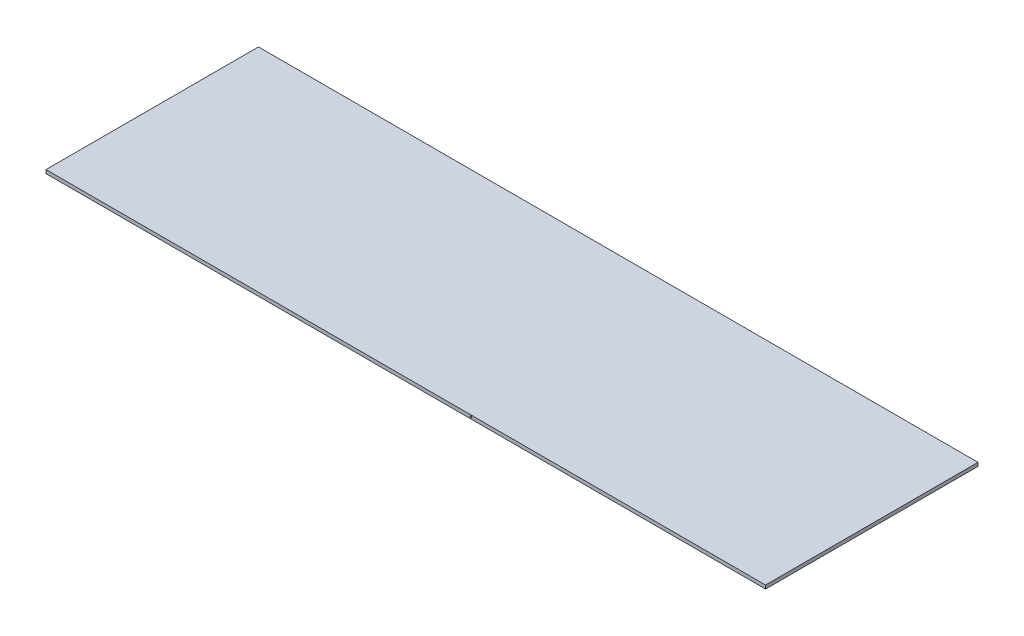
ISO-10303-21;
HEADER;
FILE_DESCRIPTION(('STEP AP214'),'2;1');
FILE_NAME('part.step','',(''),(''),'','','');
FILE_SCHEMA(('AUTOMOTIVE_DESIGN { 1 0 10303 214 1 1 1 1 }'));
ENDSEC;
DATA;
#1=APPLICATION_CONTEXT('core data for automotive mechanical design processes');
#2=APPLICATION_PROTOCOL_DEFINITION('international standard','automotive_design',2000,#1);
#3=PRODUCT_CONTEXT('',#1,'mechanical');
#4=PRODUCT('Part','Part','',(#3));
#5=PRODUCT_RELATED_PRODUCT_CATEGORY('part','',(#4));
#6=PRODUCT_DEFINITION_FORMATION('','',#4);
#7=PRODUCT_DEFINITION_CONTEXT('part definition',#1,'design');
#8=PRODUCT_DEFINITION('design','',#6,#7);
#9=PRODUCT_DEFINITION_SHAPE('','',#8);
#10=(LENGTH_UNIT() NAMED_UNIT(*) SI_UNIT(.MILLI.,.METRE.));
#11=(NAMED_UNIT(*) PLANE_ANGLE_UNIT() SI_UNIT($,.RADIAN.));
#12=(NAMED_UNIT(*) SI_UNIT($,.STERADIAN.) SOLID_ANGLE_UNIT());
#13=UNCERTAINTY_MEASURE_WITH_UNIT(LENGTH_MEASURE(1.E-05),#10,'distance_accuracy_value','');
#14=(GEOMETRIC_REPRESENTATION_CONTEXT(3) GLOBAL_UNCERTAINTY_ASSIGNED_CONTEXT((#13)) GLOBAL_UNIT_ASSIGNED_CONTEXT((#10,
#11,#12)) REPRESENTATION_CONTEXT('',''));
#15=CARTESIAN_POINT('',(0.,0.,0.));
#16=DIRECTION('',(0.,0.,1.));
#17=DIRECTION('',(1.,0.,0.));
#18=AXIS2_PLACEMENT_3D('',#15,#16,#17);
#19=CARTESIAN_POINT('',(0.,5.,0.));
#20=DIRECTION('',(1.,0.,0.));
#21=DIRECTION('',(0.,0.,-1.));
#22=AXIS2_PLACEMENT_3D('',#19,#20,#21);
#23=PLANE('',#22);
#24=DIRECTION('',(0.,0.,1.));
#25=VECTOR('',#24,1.);
#26=CARTESIAN_POINT('',(0.,0.,0.));
#27=LINE('',#26,#25);
#28=CARTESIAN_POINT('',(0.,0.,-300.));
#29=VERTEX_POINT('',#28);
#30=CARTESIAN_POINT('',(0.,0.,0.));
#31=VERTEX_POINT('',#30);
#32=EDGE_CURVE('E95',#29,#31,#27,.T.);
#33=ORIENTED_EDGE('',*,*,#32,.T.);
#34=DIRECTION('',(0.,-1.,0.));
#35=VECTOR('',#34,1.);
#36=CARTESIAN_POINT('',(0.,5.,0.));
#37=LINE('',#36,#35);
#38=CARTESIAN_POINT('',(0.,5.,0.));
#39=VERTEX_POINT('',#38);
#40=EDGE_CURVE('E11',#39,#31,#37,.T.);
#41=ORIENTED_EDGE('',*,*,#40,.F.);
#42=DIRECTION('',(0.,0.,1.));
#43=VECTOR('',#42,1.);
#44=CARTESIAN_POINT('',(0.,5.,0.));
#45=LINE('',#44,#43);
#46=CARTESIAN_POINT('',(0.,5.,-300.));
#47=VERTEX_POINT('',#46);
#48=EDGE_CURVE('E83',#47,#39,#45,.T.);
#49=ORIENTED_EDGE('',*,*,#48,.F.);
#50=DIRECTION('',(0.,-1.,0.));
#51=VECTOR('',#50,1.);
#52=CARTESIAN_POINT('',(0.,5.,-300.));
#53=LINE('',#52,#51);
#54=EDGE_CURVE('E91',#47,#29,#53,.T.);
#55=ORIENTED_EDGE('',*,*,#54,.T.);
#56=EDGE_LOOP('',(#33,#41,#49,#55));
#57=FACE_BOUND('',#56,.T.);
#58=ADVANCED_FACE('F32',(#57),#23,.F.);
#59=CARTESIAN_POINT('',(0.,5.,0.));
#60=DIRECTION('',(0.,0.,-1.));
#61=DIRECTION('',(-1.,0.,0.));
#62=AXIS2_PLACEMENT_3D('',#59,#60,#61);
#63=PLANE('',#62);
#64=CARTESIAN_POINT('',(600.,2.57626744716034,0.));
#65=DIRECTION('',(0.,0.,1.));
#66=DIRECTION('',(1.,0.,0.));
#67=AXIS2_PLACEMENT_3D('',#64,#65,#66);
#68=CIRCLE('',#67,1.24999999999996);
#69=CARTESIAN_POINT('',(601.25,2.57626744716034,0.));
#70=VERTEX_POINT('',#69);
#71=EDGE_CURVE('E109',#70,#70,#68,.T.);
#72=ORIENTED_EDGE('',*,*,#71,.F.);
#73=EDGE_LOOP('',(#72));
#74=FACE_BOUND('',#73,.T.);
#75=DIRECTION('',(1.,0.,0.));
#76=VECTOR('',#75,1.);
#77=CARTESIAN_POINT('',(0.,0.,0.));
#78=LINE('',#77,#76);
#79=CARTESIAN_POINT('',(1016.,0.,0.));
#80=VERTEX_POINT('',#79);
#81=EDGE_CURVE('E87',#31,#80,#78,.T.);
#82=ORIENTED_EDGE('',*,*,#81,.T.);
#83=DIRECTION('',(0.,-1.,0.));
#84=VECTOR('',#83,1.);
#85=CARTESIAN_POINT('',(1016.,5.,0.));
#86=LINE('',#85,#84);
#87=CARTESIAN_POINT('',(1016.,5.,0.));
#88=VERTEX_POINT('',#87);
#89=EDGE_CURVE('E40',#88,#80,#86,.T.);
#90=ORIENTED_EDGE('',*,*,#89,.F.);
#91=DIRECTION('',(1.,0.,0.));
#92=VECTOR('',#91,1.);
#93=CARTESIAN_POINT('',(0.,5.,0.));
#94=LINE('',#93,#92);
#95=EDGE_CURVE('E78',#39,#88,#94,.T.);
#96=ORIENTED_EDGE('',*,*,#95,.F.);
#97=ORIENTED_EDGE('',*,*,#40,.T.);
#98=EDGE_LOOP('',(#82,#90,#96,#97));
#99=FACE_BOUND('',#98,.T.);
#100=ADVANCED_FACE('F86',(#74,#99),#63,.F.);
#101=CARTESIAN_POINT('',(1016.,5.,0.));
#102=DIRECTION('',(-1.,0.,0.));
#103=DIRECTION('',(0.,0.,1.));
#104=AXIS2_PLACEMENT_3D('',#101,#102,#103);
#105=PLANE('',#104);
#106=DIRECTION('',(0.,0.,-1.));
#107=VECTOR('',#106,1.);
#108=CARTESIAN_POINT('',(1016.,0.,0.));
#109=LINE('',#108,#107);
#110=CARTESIAN_POINT('',(1016.,0.,-300.));
#111=VERTEX_POINT('',#110);
#112=EDGE_CURVE('E65',#80,#111,#109,.T.);
#113=ORIENTED_EDGE('',*,*,#112,.T.);
#114=DIRECTION('',(0.,-1.,0.));
#115=VECTOR('',#114,1.);
#116=CARTESIAN_POINT('',(1016.,5.,-300.));
#117=LINE('',#116,#115);
#118=CARTESIAN_POINT('',(1016.,5.,-300.));
#119=VERTEX_POINT('',#118);
#120=EDGE_CURVE('E88',#119,#111,#117,.T.);
#121=ORIENTED_EDGE('',*,*,#120,.F.);
#122=DIRECTION('',(0.,0.,-1.));
#123=VECTOR('',#122,1.);
#124=CARTESIAN_POINT('',(1016.,5.,0.));
#125=LINE('',#124,#123);
#126=EDGE_CURVE('E81',#88,#119,#125,.T.);
#127=ORIENTED_EDGE('',*,*,#126,.F.);
#128=ORIENTED_EDGE('',*,*,#89,.T.);
#129=EDGE_LOOP('',(#113,#121,#127,#128));
#130=FACE_BOUND('',#129,.T.);
#131=ADVANCED_FACE('F89',(#130),#105,.F.);
#132=CARTESIAN_POINT('',(0.,5.,-300.));
#133=DIRECTION('',(0.,0.,1.));
#134=DIRECTION('',(1.,0.,0.));
#135=AXIS2_PLACEMENT_3D('',#132,#133,#134);
#136=PLANE('',#135);
#137=CARTESIAN_POINT('',(600.,2.57626744716034,-300.));
#138=DIRECTION('',(0.,0.,1.));
#139=DIRECTION('',(1.,0.,0.));
#140=AXIS2_PLACEMENT_3D('',#137,#138,#139);
#141=CIRCLE('',#140,1.24999999999996);
#142=CARTESIAN_POINT('',(601.25,2.57626744716034,-300.));
#143=VERTEX_POINT('',#142);
#144=EDGE_CURVE('E98',#143,#143,#141,.T.);
#145=ORIENTED_EDGE('',*,*,#144,.T.);
#146=EDGE_LOOP('',(#145));
#147=FACE_BOUND('',#146,.T.);
#148=DIRECTION('',(-1.,0.,0.));
#149=VECTOR('',#148,1.);
#150=CARTESIAN_POINT('',(0.,0.,-300.));
#151=LINE('',#150,#149);
#152=EDGE_CURVE('E71',#111,#29,#151,.T.);
#153=ORIENTED_EDGE('',*,*,#152,.T.);
#154=ORIENTED_EDGE('',*,*,#54,.F.);
#155=DIRECTION('',(-1.,0.,0.));
#156=VECTOR('',#155,1.);
#157=CARTESIAN_POINT('',(0.,5.,-300.));
#158=LINE('',#157,#156);
#159=EDGE_CURVE('E48',#119,#47,#158,.T.);
#160=ORIENTED_EDGE('',*,*,#159,.F.);
#161=ORIENTED_EDGE('',*,*,#120,.T.);
#162=EDGE_LOOP('',(#153,#154,#160,#161));
#163=FACE_BOUND('',#162,.T.);
#164=ADVANCED_FACE('F103',(#147,#163),#136,.F.);
#165=CARTESIAN_POINT('',(0.,5.,0.));
#166=DIRECTION('',(0.,-1.,0.));
#167=DIRECTION('',(0.,0.,-1.));
#168=AXIS2_PLACEMENT_3D('',#165,#166,#167);
#169=PLANE('',#168);
#170=ORIENTED_EDGE('',*,*,#48,.T.);
#171=ORIENTED_EDGE('',*,*,#95,.T.);
#172=ORIENTED_EDGE('',*,*,#126,.T.);
#173=ORIENTED_EDGE('',*,*,#159,.T.);
#174=EDGE_LOOP('',(#170,#171,#172,#173));
#175=FACE_BOUND('',#174,.T.);
#176=ADVANCED_FACE('F79',(#175),#169,.F.);
#177=CARTESIAN_POINT('',(0.,0.,0.));
#178=DIRECTION('',(0.,-1.,0.));
#179=DIRECTION('',(0.,0.,-1.));
#180=AXIS2_PLACEMENT_3D('',#177,#178,#179);
#181=PLANE('',#180);
#182=ORIENTED_EDGE('',*,*,#32,.F.);
#183=ORIENTED_EDGE('',*,*,#152,.F.);
#184=ORIENTED_EDGE('',*,*,#112,.F.);
#185=ORIENTED_EDGE('',*,*,#81,.F.);
#186=EDGE_LOOP('',(#182,#183,#184,#185));
#187=FACE_BOUND('',#186,.T.);
#188=ADVANCED_FACE('F106',(#187),#181,.T.);
#189=CARTESIAN_POINT('',(600.,2.57626744716034,-300.));
#190=DIRECTION('',(0.,0.,1.));
#191=DIRECTION('',(1.,0.,0.));
#192=AXIS2_PLACEMENT_3D('',#189,#190,#191);
#193=CYLINDRICAL_SURFACE('',#192,1.24999999999996);
#194=ORIENTED_EDGE('',*,*,#144,.F.);
#195=EDGE_LOOP('',(#194));
#196=FACE_BOUND('',#195,.T.);
#197=ORIENTED_EDGE('',*,*,#71,.T.);
#198=EDGE_LOOP('',(#197));
#199=FACE_BOUND('',#198,.T.);
#200=ADVANCED_FACE('F116',(#196,#199),#193,.F.);
#201=CLOSED_SHELL('',(#58,#100,#131,#164,#176,#188,#200));
#202=MANIFOLD_SOLID_BREP('B2',#201);
#203=ADVANCED_BREP_SHAPE_REPRESENTATION('',(#18,#202),#14);
#204=SHAPE_DEFINITION_REPRESENTATION(#9,#203);
ENDSEC;
END-ISO-10303-21;
